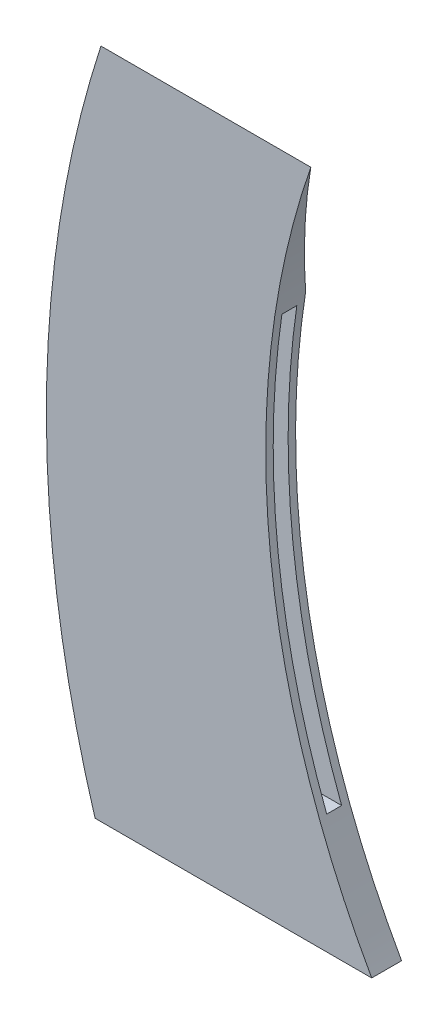
ISO-10303-21;
HEADER;
FILE_DESCRIPTION(('STEP AP214'),'2;1');
FILE_NAME('part.step','',(''),(''),'','','');
FILE_SCHEMA(('AUTOMOTIVE_DESIGN { 1 0 10303 214 1 1 1 1 }'));
ENDSEC;
DATA;
#1=APPLICATION_CONTEXT('core data for automotive mechanical design processes');
#2=APPLICATION_PROTOCOL_DEFINITION('international standard','automotive_design',2000,#1);
#3=PRODUCT_CONTEXT('',#1,'mechanical');
#4=PRODUCT('Part','Part','',(#3));
#5=PRODUCT_RELATED_PRODUCT_CATEGORY('part','',(#4));
#6=PRODUCT_DEFINITION_FORMATION('','',#4);
#7=PRODUCT_DEFINITION_CONTEXT('part definition',#1,'design');
#8=PRODUCT_DEFINITION('design','',#6,#7);
#9=PRODUCT_DEFINITION_SHAPE('','',#8);
#10=(LENGTH_UNIT() NAMED_UNIT(*) SI_UNIT(.MILLI.,.METRE.));
#11=(NAMED_UNIT(*) PLANE_ANGLE_UNIT() SI_UNIT($,.RADIAN.));
#12=(NAMED_UNIT(*) SI_UNIT($,.STERADIAN.) SOLID_ANGLE_UNIT());
#13=UNCERTAINTY_MEASURE_WITH_UNIT(LENGTH_MEASURE(1.E-05),#10,'distance_accuracy_value','');
#14=(GEOMETRIC_REPRESENTATION_CONTEXT(3) GLOBAL_UNCERTAINTY_ASSIGNED_CONTEXT((#13)) GLOBAL_UNIT_ASSIGNED_CONTEXT((#10,
#11,#12)) REPRESENTATION_CONTEXT('',''));
#15=CARTESIAN_POINT('',(0.,0.,0.));
#16=DIRECTION('',(0.,0.,1.));
#17=DIRECTION('',(1.,0.,0.));
#18=AXIS2_PLACEMENT_3D('',#15,#16,#17);
#19=CARTESIAN_POINT('',(143.476275240801,43.7556675531975,4.));
#20=DIRECTION('',(0.,0.,-1.));
#21=DIRECTION('',(-1.,0.,0.));
#22=AXIS2_PLACEMENT_3D('',#19,#20,#21);
#23=CYLINDRICAL_SURFACE('',#22,150.);
#24=CARTESIAN_POINT('',(143.476275240801,43.7556675531975,4.));
#25=DIRECTION('',(0.,0.,1.));
#26=DIRECTION('',(1.,0.,0.));
#27=AXIS2_PLACEMENT_3D('',#24,#25,#26);
#28=CIRCLE('',#27,150.);
#29=CARTESIAN_POINT('',(0.782681423315168,90.,4.));
#30=VERTEX_POINT('',#29);
#31=CARTESIAN_POINT('',(0.,0.,4.));
#32=VERTEX_POINT('',#31);
#33=EDGE_CURVE('E135',#30,#32,#28,.T.);
#34=ORIENTED_EDGE('',*,*,#33,.F.);
#35=CARTESIAN_POINT('',(143.476275240801,43.7556675531975,-5.82953630161782));
#36=DIRECTION('',(0.,-0.20791169081776,0.978147600733806));
#37=DIRECTION('',(0.,-0.978147600733806,-0.20791169081776));
#38=AXIS2_PLACEMENT_3D('',#35,#36,#37);
#39=ELLIPSE('',#38,153.351089229754,150.);
#40=CARTESIAN_POINT('',(-3.99516211454967,71.1814795620862,0.));
#41=VERTEX_POINT('',#40);
#42=EDGE_CURVE('E131',#30,#41,#39,.T.);
#43=ORIENTED_EDGE('',*,*,#42,.T.);
#44=CARTESIAN_POINT('',(143.476275240801,43.7556675531975,0.));
#45=DIRECTION('',(0.,0.,1.));
#46=DIRECTION('',(1.,0.,0.));
#47=AXIS2_PLACEMENT_3D('',#44,#45,#46);
#48=CIRCLE('',#47,150.);
#49=CARTESIAN_POINT('',(0.,0.,0.));
#50=VERTEX_POINT('',#49);
#51=EDGE_CURVE('E134',#41,#50,#48,.T.);
#52=ORIENTED_EDGE('',*,*,#51,.T.);
#53=DIRECTION('',(0.,0.,-1.));
#54=VECTOR('',#53,1.);
#55=CARTESIAN_POINT('',(0.,0.,4.));
#56=LINE('',#55,#54);
#57=EDGE_CURVE('E155',#32,#50,#56,.T.);
#58=ORIENTED_EDGE('',*,*,#57,.F.);
#59=EDGE_LOOP('',(#34,#43,#52,#58));
#60=FACE_BOUND('',#59,.T.);
#61=ADVANCED_FACE('F37',(#60),#23,.T.);
#62=CARTESIAN_POINT('',(0.,0.,4.));
#63=DIRECTION('',(0.,1.,0.));
#64=DIRECTION('',(0.,0.,1.));
#65=AXIS2_PLACEMENT_3D('',#62,#63,#64);
#66=PLANE('',#65);
#67=DIRECTION('',(1.,0.,0.));
#68=VECTOR('',#67,1.);
#69=CARTESIAN_POINT('',(0.,0.,0.));
#70=LINE('',#69,#68);
#71=CARTESIAN_POINT('',(37.0628766295716,0.,0.));
#72=VERTEX_POINT('',#71);
#73=EDGE_CURVE('E149',#50,#72,#70,.T.);
#74=ORIENTED_EDGE('',*,*,#73,.T.);
#75=DIRECTION('',(0.,0.,-1.));
#76=VECTOR('',#75,1.);
#77=CARTESIAN_POINT('',(37.0628766295716,0.,4.));
#78=LINE('',#77,#76);
#79=CARTESIAN_POINT('',(37.0628766295716,0.,4.));
#80=VERTEX_POINT('',#79);
#81=EDGE_CURVE('E147',#80,#72,#78,.T.);
#82=ORIENTED_EDGE('',*,*,#81,.F.);
#83=DIRECTION('',(1.,0.,0.));
#84=VECTOR('',#83,1.);
#85=CARTESIAN_POINT('',(0.,0.,4.));
#86=LINE('',#85,#84);
#87=EDGE_CURVE('E138',#32,#80,#86,.T.);
#88=ORIENTED_EDGE('',*,*,#87,.F.);
#89=ORIENTED_EDGE('',*,*,#57,.T.);
#90=EDGE_LOOP('',(#74,#82,#88,#89));
#91=FACE_BOUND('',#90,.T.);
#92=ADVANCED_FACE('F182',(#91),#66,.F.);
#93=CARTESIAN_POINT('',(132.864877662515,54.0553105447004,4.));
#94=DIRECTION('',(0.,0.,-1.));
#95=DIRECTION('',(-1.,0.,0.));
#96=AXIS2_PLACEMENT_3D('',#93,#94,#95);
#97=CYLINDRICAL_SURFACE('',#96,110.);
#98=DIRECTION('',(0.,0.,-1.));
#99=VECTOR('',#98,1.);
#100=CARTESIAN_POINT('',(30.031601344695,15.,4.));
#101=LINE('',#100,#99);
#102=CARTESIAN_POINT('',(30.031601344695,15.,1.));
#103=VERTEX_POINT('',#102);
#104=CARTESIAN_POINT('',(30.031601344695,15.,3.));
#105=VERTEX_POINT('',#104);
#106=EDGE_CURVE('E162',#103,#105,#101,.F.);
#107=ORIENTED_EDGE('',*,*,#106,.T.);
#108=CARTESIAN_POINT('',(132.864877662515,54.0553105447004,3.));
#109=DIRECTION('',(0.,0.,1.));
#110=DIRECTION('',(1.,0.,0.));
#111=AXIS2_PLACEMENT_3D('',#108,#109,#110);
#112=CIRCLE('',#111,110.);
#113=CARTESIAN_POINT('',(24.0266174863519,70.,3.));
#114=VERTEX_POINT('',#113);
#115=EDGE_CURVE('E11',#105,#114,#112,.F.);
#116=ORIENTED_EDGE('',*,*,#115,.T.);
#117=DIRECTION('',(0.,0.,-1.));
#118=VECTOR('',#117,1.);
#119=CARTESIAN_POINT('',(24.0266174863519,70.,4.));
#120=LINE('',#119,#118);
#121=CARTESIAN_POINT('',(24.0266174863519,70.,1.));
#122=VERTEX_POINT('',#121);
#123=EDGE_CURVE('E44',#114,#122,#120,.T.);
#124=ORIENTED_EDGE('',*,*,#123,.T.);
#125=CARTESIAN_POINT('',(132.864877662515,54.0553105447004,1.));
#126=DIRECTION('',(0.,0.,1.));
#127=DIRECTION('',(1.,0.,0.));
#128=AXIS2_PLACEMENT_3D('',#125,#126,#127);
#129=CIRCLE('',#128,110.);
#130=EDGE_CURVE('E160',#103,#122,#129,.F.);
#131=ORIENTED_EDGE('',*,*,#130,.F.);
#132=EDGE_LOOP('',(#107,#116,#124,#131));
#133=FACE_BOUND('',#132,.T.);
#134=CARTESIAN_POINT('',(132.864877662515,54.0553105447004,0.));
#135=DIRECTION('',(0.,0.,-1.));
#136=DIRECTION('',(-1.,0.,0.));
#137=AXIS2_PLACEMENT_3D('',#134,#135,#136);
#138=CIRCLE('',#137,110.);
#139=CARTESIAN_POINT('',(24.2062639460312,71.1814795620863,0.));
#140=VERTEX_POINT('',#139);
#141=EDGE_CURVE('E139',#72,#140,#138,.T.);
#142=ORIENTED_EDGE('',*,*,#141,.T.);
#143=CARTESIAN_POINT('',(132.864877662515,54.0553105447004,-3.64027960091521));
#144=DIRECTION('',(0.,-0.20791169081776,0.978147600733806));
#145=DIRECTION('',(0.,-0.978147600733806,-0.20791169081776));
#146=AXIS2_PLACEMENT_3D('',#143,#144,#145);
#147=ELLIPSE('',#146,112.457465435153,110.);
#148=CARTESIAN_POINT('',(28.903445871864,90.,4.));
#149=VERTEX_POINT('',#148);
#150=EDGE_CURVE('E59',#140,#149,#147,.F.);
#151=ORIENTED_EDGE('',*,*,#150,.T.);
#152=CARTESIAN_POINT('',(132.864877662515,54.0553105447004,4.));
#153=DIRECTION('',(0.,0.,-1.));
#154=DIRECTION('',(-1.,0.,0.));
#155=AXIS2_PLACEMENT_3D('',#152,#153,#154);
#156=CIRCLE('',#155,110.);
#157=EDGE_CURVE('E141',#80,#149,#156,.T.);
#158=ORIENTED_EDGE('',*,*,#157,.F.);
#159=ORIENTED_EDGE('',*,*,#81,.T.);
#160=EDGE_LOOP('',(#142,#151,#158,#159));
#161=FACE_BOUND('',#160,.T.);
#162=ADVANCED_FACE('F166',(#133,#161),#97,.F.);
#163=CARTESIAN_POINT('',(143.476275240801,43.7556675531975,4.));
#164=DIRECTION('',(0.,0.,1.));
#165=DIRECTION('',(1.,0.,0.));
#166=AXIS2_PLACEMENT_3D('',#163,#164,#165);
#167=PLANE('',#166);
#168=ORIENTED_EDGE('',*,*,#33,.T.);
#169=ORIENTED_EDGE('',*,*,#87,.T.);
#170=ORIENTED_EDGE('',*,*,#157,.T.);
#171=DIRECTION('',(-1.,0.,0.));
#172=VECTOR('',#171,1.);
#173=CARTESIAN_POINT('',(0.782681423315168,90.,4.));
#174=LINE('',#173,#172);
#175=EDGE_CURVE('E144',#149,#30,#174,.T.);
#176=ORIENTED_EDGE('',*,*,#175,.T.);
#177=EDGE_LOOP('',(#168,#169,#170,#176));
#178=FACE_BOUND('',#177,.T.);
#179=ADVANCED_FACE('F192',(#178),#167,.T.);
#180=CARTESIAN_POINT('',(143.476275240801,43.7556675531975,0.));
#181=DIRECTION('',(0.,0.,1.));
#182=DIRECTION('',(1.,0.,0.));
#183=AXIS2_PLACEMENT_3D('',#180,#181,#182);
#184=PLANE('',#183);
#185=ORIENTED_EDGE('',*,*,#51,.F.);
#186=DIRECTION('',(1.,0.,0.));
#187=VECTOR('',#186,1.);
#188=CARTESIAN_POINT('',(143.476275240801,71.1814795620863,0.));
#189=LINE('',#188,#187);
#190=EDGE_CURVE('E158',#41,#140,#189,.T.);
#191=ORIENTED_EDGE('',*,*,#190,.T.);
#192=ORIENTED_EDGE('',*,*,#141,.F.);
#193=ORIENTED_EDGE('',*,*,#73,.F.);
#194=EDGE_LOOP('',(#185,#191,#192,#193));
#195=FACE_BOUND('',#194,.T.);
#196=ADVANCED_FACE('F199',(#195),#184,.F.);
#197=CARTESIAN_POINT('',(-6.5237247591991,90.,4.));
#198=DIRECTION('',(0.,-0.20791169081776,0.978147600733806));
#199=DIRECTION('',(0.,-0.978147600733806,-0.20791169081776));
#200=AXIS2_PLACEMENT_3D('',#197,#198,#199);
#201=PLANE('',#200);
#202=ORIENTED_EDGE('',*,*,#175,.F.);
#203=ORIENTED_EDGE('',*,*,#150,.F.);
#204=ORIENTED_EDGE('',*,*,#190,.F.);
#205=ORIENTED_EDGE('',*,*,#42,.F.);
#206=EDGE_LOOP('',(#202,#203,#204,#205));
#207=FACE_BOUND('',#206,.T.);
#208=ADVANCED_FACE('F195',(#207),#201,.F.);
#209=CARTESIAN_POINT('',(38.,70.,3.));
#210=DIRECTION('',(0.,1.,0.));
#211=DIRECTION('',(0.,0.,1.));
#212=AXIS2_PLACEMENT_3D('',#209,#210,#211);
#213=PLANE('',#212);
#214=DIRECTION('',(1.,0.,0.));
#215=VECTOR('',#214,1.);
#216=CARTESIAN_POINT('',(38.,70.,3.));
#217=LINE('',#216,#215);
#218=CARTESIAN_POINT('',(8.,70.,3.));
#219=VERTEX_POINT('',#218);
#220=EDGE_CURVE('E118',#219,#114,#217,.T.);
#221=ORIENTED_EDGE('',*,*,#220,.F.);
#222=DIRECTION('',(0.,0.,-1.));
#223=VECTOR('',#222,1.);
#224=CARTESIAN_POINT('',(8.,70.,3.));
#225=LINE('',#224,#223);
#226=CARTESIAN_POINT('',(8.,70.,1.));
#227=VERTEX_POINT('',#226);
#228=EDGE_CURVE('E117',#219,#227,#225,.T.);
#229=ORIENTED_EDGE('',*,*,#228,.T.);
#230=DIRECTION('',(1.,0.,0.));
#231=VECTOR('',#230,1.);
#232=CARTESIAN_POINT('',(38.,70.,1.));
#233=LINE('',#232,#231);
#234=EDGE_CURVE('E110',#227,#122,#233,.T.);
#235=ORIENTED_EDGE('',*,*,#234,.T.);
#236=ORIENTED_EDGE('',*,*,#123,.F.);
#237=EDGE_LOOP('',(#221,#229,#235,#236));
#238=FACE_BOUND('',#237,.T.);
#239=ADVANCED_FACE('F169',(#238),#213,.F.);
#240=CARTESIAN_POINT('',(38.,15.,3.));
#241=DIRECTION('',(0.,-1.,0.));
#242=DIRECTION('',(0.,0.,-1.));
#243=AXIS2_PLACEMENT_3D('',#240,#241,#242);
#244=PLANE('',#243);
#245=DIRECTION('',(-1.,0.,0.));
#246=VECTOR('',#245,1.);
#247=CARTESIAN_POINT('',(38.,15.,1.));
#248=LINE('',#247,#246);
#249=CARTESIAN_POINT('',(8.,15.,1.));
#250=VERTEX_POINT('',#249);
#251=EDGE_CURVE('E51',#103,#250,#248,.T.);
#252=ORIENTED_EDGE('',*,*,#251,.T.);
#253=DIRECTION('',(0.,0.,-1.));
#254=VECTOR('',#253,1.);
#255=CARTESIAN_POINT('',(8.,15.,3.));
#256=LINE('',#255,#254);
#257=CARTESIAN_POINT('',(8.,15.,3.));
#258=VERTEX_POINT('',#257);
#259=EDGE_CURVE('E113',#258,#250,#256,.T.);
#260=ORIENTED_EDGE('',*,*,#259,.F.);
#261=DIRECTION('',(-1.,0.,0.));
#262=VECTOR('',#261,1.);
#263=CARTESIAN_POINT('',(38.,15.,3.));
#264=LINE('',#263,#262);
#265=EDGE_CURVE('E101',#105,#258,#264,.T.);
#266=ORIENTED_EDGE('',*,*,#265,.F.);
#267=ORIENTED_EDGE('',*,*,#106,.F.);
#268=EDGE_LOOP('',(#252,#260,#266,#267));
#269=FACE_BOUND('',#268,.T.);
#270=ADVANCED_FACE('F114',(#269),#244,.F.);
#271=CARTESIAN_POINT('',(0.,0.,3.));
#272=DIRECTION('',(0.,0.,1.));
#273=DIRECTION('',(1.,0.,0.));
#274=AXIS2_PLACEMENT_3D('',#271,#272,#273);
#275=PLANE('',#274);
#276=ORIENTED_EDGE('',*,*,#265,.T.);
#277=DIRECTION('',(0.,1.,0.));
#278=VECTOR('',#277,1.);
#279=CARTESIAN_POINT('',(8.,15.,3.));
#280=LINE('',#279,#278);
#281=EDGE_CURVE('E106',#258,#219,#280,.T.);
#282=ORIENTED_EDGE('',*,*,#281,.T.);
#283=ORIENTED_EDGE('',*,*,#220,.T.);
#284=ORIENTED_EDGE('',*,*,#115,.F.);
#285=EDGE_LOOP('',(#276,#282,#283,#284));
#286=FACE_BOUND('',#285,.T.);
#287=ADVANCED_FACE('F103',(#286),#275,.F.);
#288=CARTESIAN_POINT('',(0.,0.,1.));
#289=DIRECTION('',(0.,0.,1.));
#290=DIRECTION('',(1.,0.,0.));
#291=AXIS2_PLACEMENT_3D('',#288,#289,#290);
#292=PLANE('',#291);
#293=ORIENTED_EDGE('',*,*,#130,.T.);
#294=ORIENTED_EDGE('',*,*,#234,.F.);
#295=DIRECTION('',(0.,1.,0.));
#296=VECTOR('',#295,1.);
#297=CARTESIAN_POINT('',(8.,15.,1.));
#298=LINE('',#297,#296);
#299=EDGE_CURVE('E125',#250,#227,#298,.T.);
#300=ORIENTED_EDGE('',*,*,#299,.F.);
#301=ORIENTED_EDGE('',*,*,#251,.F.);
#302=EDGE_LOOP('',(#293,#294,#300,#301));
#303=FACE_BOUND('',#302,.T.);
#304=ADVANCED_FACE('F171',(#303),#292,.T.);
#305=CARTESIAN_POINT('',(8.,15.,3.));
#306=DIRECTION('',(-1.,0.,0.));
#307=DIRECTION('',(0.,0.,1.));
#308=AXIS2_PLACEMENT_3D('',#305,#306,#307);
#309=PLANE('',#308);
#310=ORIENTED_EDGE('',*,*,#299,.T.);
#311=ORIENTED_EDGE('',*,*,#228,.F.);
#312=ORIENTED_EDGE('',*,*,#281,.F.);
#313=ORIENTED_EDGE('',*,*,#259,.T.);
#314=EDGE_LOOP('',(#310,#311,#312,#313));
#315=FACE_BOUND('',#314,.T.);
#316=ADVANCED_FACE('F120',(#315),#309,.F.);
#317=CLOSED_SHELL('',(#61,#92,#162,#179,#196,#208,#239,#270,#287,#304,#316));
#318=MANIFOLD_SOLID_BREP('B2',#317);
#319=ADVANCED_BREP_SHAPE_REPRESENTATION('',(#18,#318),#14);
#320=SHAPE_DEFINITION_REPRESENTATION(#9,#319);
ENDSEC;
END-ISO-10303-21;
